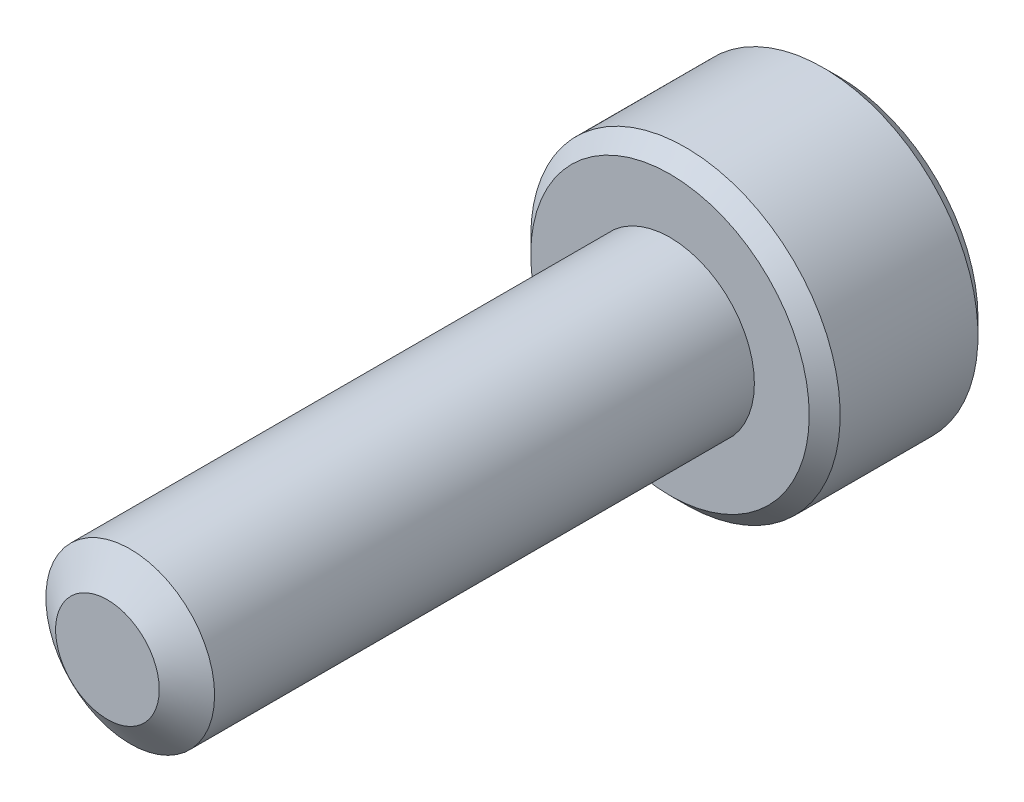
ISO-10303-21;
HEADER;
FILE_DESCRIPTION(('STEP AP214'),'2;1');
FILE_NAME('part.step','',(''),(''),'','','');
FILE_SCHEMA(('AUTOMOTIVE_DESIGN { 1 0 10303 214 1 1 1 1 }'));
ENDSEC;
DATA;
#1=APPLICATION_CONTEXT('core data for automotive mechanical design processes');
#2=APPLICATION_PROTOCOL_DEFINITION('international standard','automotive_design',2000,#1);
#3=PRODUCT_CONTEXT('',#1,'mechanical');
#4=PRODUCT('Part','Part','',(#3));
#5=PRODUCT_RELATED_PRODUCT_CATEGORY('part','',(#4));
#6=PRODUCT_DEFINITION_FORMATION('','',#4);
#7=PRODUCT_DEFINITION_CONTEXT('part definition',#1,'design');
#8=PRODUCT_DEFINITION('design','',#6,#7);
#9=PRODUCT_DEFINITION_SHAPE('','',#8);
#10=(LENGTH_UNIT() NAMED_UNIT(*) SI_UNIT(.MILLI.,.METRE.));
#11=(NAMED_UNIT(*) PLANE_ANGLE_UNIT() SI_UNIT($,.RADIAN.));
#12=(NAMED_UNIT(*) SI_UNIT($,.STERADIAN.) SOLID_ANGLE_UNIT());
#13=UNCERTAINTY_MEASURE_WITH_UNIT(LENGTH_MEASURE(1.E-05),#10,'distance_accuracy_value','');
#14=(GEOMETRIC_REPRESENTATION_CONTEXT(3) GLOBAL_UNCERTAINTY_ASSIGNED_CONTEXT((#13)) GLOBAL_UNIT_ASSIGNED_CONTEXT((#10,
#11,#12)) REPRESENTATION_CONTEXT('',''));
#15=CARTESIAN_POINT('',(0.,0.,0.));
#16=DIRECTION('',(0.,0.,1.));
#17=DIRECTION('',(1.,0.,0.));
#18=AXIS2_PLACEMENT_3D('',#15,#16,#17);
#19=CARTESIAN_POINT('',(0.,0.,-10.));
#20=DIRECTION('',(0.,0.,1.));
#21=DIRECTION('',(1.,0.,0.));
#22=AXIS2_PLACEMENT_3D('',#19,#20,#21);
#23=CYLINDRICAL_SURFACE('',#22,1.5);
#24=CARTESIAN_POINT('',(0.,0.,-10.));
#25=DIRECTION('',(0.,0.,-1.));
#26=DIRECTION('',(-1.,0.,0.));
#27=AXIS2_PLACEMENT_3D('',#24,#25,#26);
#28=CIRCLE('',#27,1.5);
#29=CARTESIAN_POINT('',(-1.5,0.,-10.));
#30=VERTEX_POINT('',#29);
#31=EDGE_CURVE('E209',#30,#30,#28,.F.);
#32=ORIENTED_EDGE('',*,*,#31,.T.);
#33=EDGE_LOOP('',(#32));
#34=FACE_BOUND('',#33,.T.);
#35=CARTESIAN_POINT('',(0.,0.,-0.40525178320938));
#36=DIRECTION('',(0.,0.,1.));
#37=DIRECTION('',(1.,0.,0.));
#38=AXIS2_PLACEMENT_3D('',#35,#36,#37);
#39=CIRCLE('',#38,1.5);
#40=CARTESIAN_POINT('',(1.5,0.,-0.40525178320938));
#41=VERTEX_POINT('',#40);
#42=EDGE_CURVE('E106',#41,#41,#39,.T.);
#43=ORIENTED_EDGE('',*,*,#42,.F.);
#44=EDGE_LOOP('',(#43));
#45=FACE_BOUND('',#44,.T.);
#46=ADVANCED_FACE('F32',(#34,#45),#23,.T.);
#47=CARTESIAN_POINT('',(0.,0.,0.));
#48=DIRECTION('',(0.,0.,-1.));
#49=DIRECTION('',(-1.,0.,0.));
#50=AXIS2_PLACEMENT_3D('',#47,#48,#49);
#51=CONICAL_SURFACE('',#50,0.921240473580834,0.959931088596884);
#52=ORIENTED_EDGE('',*,*,#42,.T.);
#53=EDGE_LOOP('',(#52));
#54=FACE_BOUND('',#53,.T.);
#55=CARTESIAN_POINT('',(0.,0.,0.));
#56=DIRECTION('',(0.,0.,1.));
#57=DIRECTION('',(1.,0.,0.));
#58=AXIS2_PLACEMENT_3D('',#55,#56,#57);
#59=CIRCLE('',#58,0.921240473580834);
#60=CARTESIAN_POINT('',(0.921240473580834,0.,0.));
#61=VERTEX_POINT('',#60);
#62=EDGE_CURVE('E207',#61,#61,#59,.T.);
#63=ORIENTED_EDGE('',*,*,#62,.F.);
#64=EDGE_LOOP('',(#63));
#65=FACE_BOUND('',#64,.T.);
#66=ADVANCED_FACE('F190',(#54,#65),#51,.T.);
#67=CARTESIAN_POINT('',(0.,0.,0.));
#68=DIRECTION('',(0.,0.,1.));
#69=DIRECTION('',(1.,0.,0.));
#70=AXIS2_PLACEMENT_3D('',#67,#68,#69);
#71=PLANE('',#70);
#72=ORIENTED_EDGE('',*,*,#62,.T.);
#73=EDGE_LOOP('',(#72));
#74=FACE_BOUND('',#73,.T.);
#75=ADVANCED_FACE('F187',(#74),#71,.T.);
#76=CARTESIAN_POINT('',(0.,0.,-13.));
#77=DIRECTION('',(0.,0.,1.));
#78=DIRECTION('',(1.,0.,0.));
#79=AXIS2_PLACEMENT_3D('',#76,#77,#78);
#80=CYLINDRICAL_SURFACE('',#79,2.75);
#81=CARTESIAN_POINT('',(0.,0.,-12.725));
#82=DIRECTION('',(0.,0.,-1.));
#83=DIRECTION('',(-1.,0.,0.));
#84=AXIS2_PLACEMENT_3D('',#81,#82,#83);
#85=CIRCLE('',#84,2.75);
#86=CARTESIAN_POINT('',(-2.75,0.,-12.725));
#87=VERTEX_POINT('',#86);
#88=EDGE_CURVE('E40',#87,#87,#85,.F.);
#89=ORIENTED_EDGE('',*,*,#88,.T.);
#90=EDGE_LOOP('',(#89));
#91=FACE_BOUND('',#90,.T.);
#92=CARTESIAN_POINT('',(0.,0.,-10.275));
#93=DIRECTION('',(0.,0.,-1.));
#94=DIRECTION('',(-1.,0.,0.));
#95=AXIS2_PLACEMENT_3D('',#92,#93,#94);
#96=CIRCLE('',#95,2.75);
#97=CARTESIAN_POINT('',(-2.75,0.,-10.275));
#98=VERTEX_POINT('',#97);
#99=EDGE_CURVE('E166',#98,#98,#96,.T.);
#100=ORIENTED_EDGE('',*,*,#99,.T.);
#101=EDGE_LOOP('',(#100));
#102=FACE_BOUND('',#101,.T.);
#103=ADVANCED_FACE('F171',(#91,#102),#80,.T.);
#104=CARTESIAN_POINT('',(0.,0.,-13.));
#105=DIRECTION('',(0.,0.,-1.));
#106=DIRECTION('',(-1.,0.,0.));
#107=AXIS2_PLACEMENT_3D('',#104,#105,#106);
#108=PLANE('',#107);
#109=CARTESIAN_POINT('',(0.,0.,-13.));
#110=DIRECTION('',(0.,0.,-1.));
#111=DIRECTION('',(-1.,0.,0.));
#112=AXIS2_PLACEMENT_3D('',#109,#110,#111);
#113=CIRCLE('',#112,2.475);
#114=CARTESIAN_POINT('',(-2.475,0.,-13.));
#115=VERTEX_POINT('',#114);
#116=EDGE_CURVE('E105',#115,#115,#113,.T.);
#117=ORIENTED_EDGE('',*,*,#116,.T.);
#118=EDGE_LOOP('',(#117));
#119=FACE_BOUND('',#118,.T.);
#120=CARTESIAN_POINT('',(0.,0.,-13.));
#121=DIRECTION('',(0.,0.,-1.));
#122=DIRECTION('',(-1.,0.,0.));
#123=AXIS2_PLACEMENT_3D('',#120,#121,#122);
#124=CIRCLE('',#123,1.44337567297406);
#125=CARTESIAN_POINT('',(-1.25,0.721687836487031,-13.));
#126=VERTEX_POINT('',#125);
#127=CARTESIAN_POINT('',(0.,1.44337567297406,-13.));
#128=VERTEX_POINT('',#127);
#129=EDGE_CURVE('E86',#126,#128,#124,.T.);
#130=ORIENTED_EDGE('',*,*,#129,.F.);
#131=CARTESIAN_POINT('',(-1.25,-0.721687836487032,-13.));
#132=VERTEX_POINT('',#131);
#133=EDGE_CURVE('E46',#132,#126,#124,.T.);
#134=ORIENTED_EDGE('',*,*,#133,.F.);
#135=CARTESIAN_POINT('',(0.,-1.44337567297406,-13.));
#136=VERTEX_POINT('',#135);
#137=EDGE_CURVE('E265',#136,#132,#124,.T.);
#138=ORIENTED_EDGE('',*,*,#137,.F.);
#139=CARTESIAN_POINT('',(1.25,-0.721687836487032,-13.));
#140=VERTEX_POINT('',#139);
#141=EDGE_CURVE('E53',#140,#136,#124,.T.);
#142=ORIENTED_EDGE('',*,*,#141,.F.);
#143=CARTESIAN_POINT('',(1.25,0.721687836487033,-13.));
#144=VERTEX_POINT('',#143);
#145=EDGE_CURVE('E127',#144,#140,#124,.T.);
#146=ORIENTED_EDGE('',*,*,#145,.F.);
#147=EDGE_CURVE('E95',#128,#144,#124,.T.);
#148=ORIENTED_EDGE('',*,*,#147,.F.);
#149=EDGE_LOOP('',(#130,#134,#138,#142,#146,#148));
#150=FACE_BOUND('',#149,.T.);
#151=ADVANCED_FACE('F126',(#119,#150),#108,.T.);
#152=CARTESIAN_POINT('',(0.,0.,-10.));
#153=DIRECTION('',(0.,0.,-1.));
#154=DIRECTION('',(-1.,0.,0.));
#155=AXIS2_PLACEMENT_3D('',#152,#153,#154);
#156=PLANE('',#155);
#157=CARTESIAN_POINT('',(0.,0.,-10.));
#158=DIRECTION('',(0.,0.,-1.));
#159=DIRECTION('',(-1.,0.,0.));
#160=AXIS2_PLACEMENT_3D('',#157,#158,#159);
#161=CIRCLE('',#160,2.475);
#162=CARTESIAN_POINT('',(-2.475,0.,-10.));
#163=VERTEX_POINT('',#162);
#164=EDGE_CURVE('E11',#163,#163,#161,.F.);
#165=ORIENTED_EDGE('',*,*,#164,.T.);
#166=EDGE_LOOP('',(#165));
#167=FACE_BOUND('',#166,.T.);
#168=ORIENTED_EDGE('',*,*,#31,.F.);
#169=EDGE_LOOP('',(#168));
#170=FACE_BOUND('',#169,.T.);
#171=ADVANCED_FACE('F180',(#167,#170),#156,.F.);
#172=CARTESIAN_POINT('',(0.,0.,-13.));
#173=DIRECTION('',(0.,0.,-1.));
#174=DIRECTION('',(-1.,0.,0.));
#175=AXIS2_PLACEMENT_3D('',#172,#173,#174);
#176=CONICAL_SURFACE('',#175,1.44337567297406,0.78539816339745);
#177=ORIENTED_EDGE('',*,*,#147,.T.);
#178=CARTESIAN_POINT('',(-0.000199999999999518,1.4434911430279,-13.0001154839091));
#179=CARTESIAN_POINT('',(0.0427751670715875,1.41867941875065,-12.9753216680551));
#180=CARTESIAN_POINT('',(0.0864690047459492,1.39345276980743,-12.9519837344187));
#181=CARTESIAN_POINT('',(0.175565930841943,1.34201263554194,-12.9092520040845));
#182=CARTESIAN_POINT('',(0.220977498357065,1.31579425481276,-12.8898819923604));
#183=CARTESIAN_POINT('',(0.312547820935261,1.26292610442246,-12.8567004834135));
#184=CARTESIAN_POINT('',(0.358683240175887,1.23628980770471,-12.8428055590527));
#185=CARTESIAN_POINT('',(0.451970080407593,1.18243062538508,-12.8213972821606));
#186=CARTESIAN_POINT('',(0.499118649136381,1.15520938653761,-12.8138679415668));
#187=CARTESIAN_POINT('',(0.580373556887253,1.10829684367467,-12.8070744980507));
#188=CARTESIAN_POINT('',(0.614374876627942,1.08866617256958,-12.8060685591044));
#189=CARTESIAN_POINT('',(0.682317764432479,1.04943932800611,-12.8077614149113));
#190=CARTESIAN_POINT('',(0.716259317655658,1.02984316311599,-12.8104610272155));
#191=CARTESIAN_POINT('',(0.7838148564575,0.990839954603498,-12.8194089303164));
#192=CARTESIAN_POINT('',(0.817428507286776,0.97143310424877,-12.8256605258997));
#193=CARTESIAN_POINT('',(0.884094638217814,0.932943395609905,-12.8413756814139));
#194=CARTESIAN_POINT('',(0.917146871030297,0.9138606800983,-12.8508406200875));
#195=CARTESIAN_POINT('',(1.00179969160026,0.864986351354567,-12.8789313906876));
#196=CARTESIAN_POINT('',(1.05286649242964,0.835502920149076,-12.8996701574522));
#197=CARTESIAN_POINT('',(1.15300085411325,0.777690319475909,-12.9463871346715));
#198=CARTESIAN_POINT('',(1.20207431157827,0.749357745598417,-12.9723482959468));
#199=CARTESIAN_POINT('',(1.2502,0.721572366433194,-13.0001154839091));
#200=B_SPLINE_CURVE_WITH_KNOTS('',3,(#178,#179,#180,#181,#182,#183,#184,#185,#186,#187,#188,
#189,#190,#191,#192,#193,#194,#195,#196,#197,#198,#199),.UNSPECIFIED.,.F.,.F.,(4,2,2,2,2,2,2,2,
2,2,4),(0.,0.166533409618305,0.334037607289762,0.498880396489699,0.663307919240275,
0.780963963458827,0.898645970148453,1.01643764860773,1.1342799317155,1.32148652032141,
1.50809158792573),.UNSPECIFIED.);
#201=EDGE_CURVE('E100',#128,#144,#200,.T.);
#202=ORIENTED_EDGE('',*,*,#201,.F.);
#203=EDGE_LOOP('',(#177,#202));
#204=FACE_BOUND('',#203,.T.);
#205=ADVANCED_FACE('F101',(#204),#176,.F.);
#206=ORIENTED_EDGE('',*,*,#145,.T.);
#207=CARTESIAN_POINT('',(1.25,-1.43934010808077,-13.4629820968923));
#208=CARTESIAN_POINT('',(1.25,-1.40429313005659,-13.4365249226329));
#209=CARTESIAN_POINT('',(1.25,-1.36905087135599,-13.4103271603543));
#210=CARTESIAN_POINT('',(1.25,-1.29809650706311,-13.3585575718396));
#211=CARTESIAN_POINT('',(1.25,-1.26238428576495,-13.3329859043563));
#212=CARTESIAN_POINT('',(1.25,-1.15390111792708,-13.2570059936895));
#213=CARTESIAN_POINT('',(1.25,-1.08031646726264,-13.2077402861896));
#214=CARTESIAN_POINT('',(1.25,-0.926012322755096,-13.1110258302631));
#215=CARTESIAN_POINT('',(1.25,-0.845125318656147,-13.0638412989418));
#216=CARTESIAN_POINT('',(1.25,-0.679311174076603,-12.9775307343904));
#217=CARTESIAN_POINT('',(1.25,-0.594398891026688,-12.9383775346269));
#218=CARTESIAN_POINT('',(1.25,-0.46694481246074,-12.8904772236883));
#219=CARTESIAN_POINT('',(1.25,-0.426289985812821,-12.8767294897863));
#220=CARTESIAN_POINT('',(1.25,-0.343998850091267,-12.8524979274505));
#221=CARTESIAN_POINT('',(1.25,-0.302362473614962,-12.8420143238698));
#222=CARTESIAN_POINT('',(1.25,-0.219052696285665,-12.8250301617483));
#223=CARTESIAN_POINT('',(1.25,-0.1773934284745,-12.8184613604714));
#224=CARTESIAN_POINT('',(1.25,-0.093629369340192,-12.8094350534578));
#225=CARTESIAN_POINT('',(1.25,-0.051524655854396,-12.8069768409973));
#226=CARTESIAN_POINT('',(1.25,0.0311890576306316,-12.8063540620133));
#227=CARTESIAN_POINT('',(1.25,0.0717969625499305,-12.8080371168462));
#228=CARTESIAN_POINT('',(1.25,0.152668636885197,-12.8152682705979));
#229=CARTESIAN_POINT('',(1.25,0.192932338835358,-12.8208171104131));
#230=CARTESIAN_POINT('',(1.25,0.273499879165296,-12.835571036465));
#231=CARTESIAN_POINT('',(1.25,0.313792180618512,-12.8448381759641));
#232=CARTESIAN_POINT('',(1.25,0.393496413911458,-12.8665361784573));
#233=CARTESIAN_POINT('',(1.25,0.43290841911506,-12.8789667767306));
#234=CARTESIAN_POINT('',(1.25,0.556992735862298,-12.9227793529314));
#235=CARTESIAN_POINT('',(1.25,0.639898924666086,-12.959151072876));
#236=CARTESIAN_POINT('',(1.25,0.801816555499702,-13.0400191621783));
#237=CARTESIAN_POINT('',(1.25,0.880812666325045,-13.084544720912));
#238=CARTESIAN_POINT('',(1.25,1.0317856127975,-13.1764048766666));
#239=CARTESIAN_POINT('',(1.25,1.10391618485086,-13.2234899339163));
#240=CARTESIAN_POINT('',(1.25,1.21018606043311,-13.2962785615985));
#241=CARTESIAN_POINT('',(1.25,1.2451506996938,-13.3207980853934));
#242=CARTESIAN_POINT('',(1.25,1.31460220852737,-13.3704856367657));
#243=CARTESIAN_POINT('',(1.25,1.34908920596618,-13.3956534854155));
#244=CARTESIAN_POINT('',(1.25,1.38337731682912,-13.4210901488412));
#245=B_SPLINE_CURVE_WITH_KNOTS('',3,(#207,#208,#209,#210,#211,#212,#213,#214,#215,#216,#217,
#218,#219,#220,#221,#222,#223,#224,#225,#226,#227,#228,#229,#230,#231,#232,#233,#234,#235,#236,
#237,#238,#239,#240,#241,#242,#243,#244),.UNSPECIFIED.,.F.,.F.,(4,2,2,2,2,2,2,2,2,2,2,2,2,2,2,2,
2,2,4),(0.,0.131732960381448,0.263498984161645,0.529042014455825,0.809741926134617,
1.08947609717225,1.21811634272576,1.346765447839,1.47310084517844,1.59941451973784,
1.72115042167849,1.84290966131735,1.96679153905342,2.09066305366039,2.36146692896009,
2.63325989198491,2.89154668212279,3.01965734507713,3.14773302245628),.UNSPECIFIED.);
#246=EDGE_CURVE('E94',#144,#140,#245,.F.);
#247=ORIENTED_EDGE('',*,*,#246,.F.);
#248=EDGE_LOOP('',(#206,#247));
#249=FACE_BOUND('',#248,.T.);
#250=ADVANCED_FACE('F271',(#249),#176,.F.);
#251=ORIENTED_EDGE('',*,*,#141,.T.);
#252=CARTESIAN_POINT('',(1.2502,-0.721572366433195,-13.0001154839091));
#253=CARTESIAN_POINT('',(1.20722483292841,-0.746384090710445,-12.9753216680551));
#254=CARTESIAN_POINT('',(1.16353099525405,-0.771610739653665,-12.9519837344187));
#255=CARTESIAN_POINT('',(1.07443406915806,-0.823050873919155,-12.9092520040845));
#256=CARTESIAN_POINT('',(1.02902250164294,-0.849269254648334,-12.8898819923604));
#257=CARTESIAN_POINT('',(0.93745217906474,-0.902137405038636,-12.8567004834135));
#258=CARTESIAN_POINT('',(0.891316759824114,-0.928773701756388,-12.8428055590527));
#259=CARTESIAN_POINT('',(0.798029919592408,-0.982632884076013,-12.8213972821606));
#260=CARTESIAN_POINT('',(0.75088135086362,-1.00985412292348,-12.8138679415668));
#261=CARTESIAN_POINT('',(0.669626443112748,-1.05676666578643,-12.8070744980507));
#262=CARTESIAN_POINT('',(0.635625123372059,-1.07639733689152,-12.8060685591044));
#263=CARTESIAN_POINT('',(0.567682235567523,-1.11562418145499,-12.8077614149113));
#264=CARTESIAN_POINT('',(0.533740682344343,-1.1352203463451,-12.8104610272155));
#265=CARTESIAN_POINT('',(0.466185143542501,-1.1742235548576,-12.8194089303164));
#266=CARTESIAN_POINT('',(0.432571492713226,-1.19363040521233,-12.8256605258997));
#267=CARTESIAN_POINT('',(0.365905361782187,-1.23212011385119,-12.8413756814139));
#268=CARTESIAN_POINT('',(0.332853128969705,-1.2512028293628,-12.8508406200875));
#269=CARTESIAN_POINT('',(0.248200308399736,-1.30007715810653,-12.8789313906876));
#270=CARTESIAN_POINT('',(0.197133507570362,-1.32956058931202,-12.8996701574522));
#271=CARTESIAN_POINT('',(0.0969991458867458,-1.38737318998519,-12.9463871346715));
#272=CARTESIAN_POINT('',(0.0479256884217313,-1.41570576386268,-12.9723482959468));
#273=CARTESIAN_POINT('',(-0.000199999999999432,-1.4434911430279,-13.0001154839091));
#274=B_SPLINE_CURVE_WITH_KNOTS('',3,(#252,#253,#254,#255,#256,#257,#258,#259,#260,#261,#262,
#263,#264,#265,#266,#267,#268,#269,#270,#271,#272,#273),.UNSPECIFIED.,.F.,.F.,(4,2,2,2,2,2,2,2,
2,2,4),(0.,0.166533409618304,0.334037607289761,0.498880396489698,0.663307919240274,
0.780963963458826,0.898645970148452,1.01643764860773,1.13427993171549,1.32148652032141,
1.50809158792573),.UNSPECIFIED.);
#275=EDGE_CURVE('E136',#140,#136,#274,.T.);
#276=ORIENTED_EDGE('',*,*,#275,.F.);
#277=EDGE_LOOP('',(#251,#276));
#278=FACE_BOUND('',#277,.T.);
#279=ADVANCED_FACE('F268',(#278),#176,.F.);
#280=ORIENTED_EDGE('',*,*,#137,.T.);
#281=CARTESIAN_POINT('',(0.000200000000000315,-1.4434911430279,-13.0001154839091));
#282=CARTESIAN_POINT('',(-0.0427751670715862,-1.41867941875065,-12.9753216680551));
#283=CARTESIAN_POINT('',(-0.0864690047459475,-1.39345276980743,-12.9519837344187));
#284=CARTESIAN_POINT('',(-0.175565930841941,-1.34201263554194,-12.9092520040845));
#285=CARTESIAN_POINT('',(-0.220977498357063,-1.31579425481276,-12.8898819923604));
#286=CARTESIAN_POINT('',(-0.312547820935259,-1.26292610442246,-12.8567004834135));
#287=CARTESIAN_POINT('',(-0.358683240175885,-1.23628980770471,-12.8428055590527));
#288=CARTESIAN_POINT('',(-0.451970080407592,-1.18243062538508,-12.8213972821606));
#289=CARTESIAN_POINT('',(-0.499118649136379,-1.15520938653761,-12.8138679415668));
#290=CARTESIAN_POINT('',(-0.580373556887252,-1.10829684367467,-12.8070744980507));
#291=CARTESIAN_POINT('',(-0.61437487662794,-1.08866617256958,-12.8060685591044));
#292=CARTESIAN_POINT('',(-0.682317764432477,-1.04943932800611,-12.8077614149113));
#293=CARTESIAN_POINT('',(-0.716259317655657,-1.02984316311599,-12.8104610272155));
#294=CARTESIAN_POINT('',(-0.783814856457499,-0.9908399546035,-12.8194089303164));
#295=CARTESIAN_POINT('',(-0.817428507286774,-0.971433104248772,-12.8256605258997));
#296=CARTESIAN_POINT('',(-0.884094638217813,-0.932943395609906,-12.8413756814139));
#297=CARTESIAN_POINT('',(-0.917146871030295,-0.913860680098301,-12.8508406200875));
#298=CARTESIAN_POINT('',(-1.00179969160026,-0.864986351354568,-12.8789313906876));
#299=CARTESIAN_POINT('',(-1.05286649242964,-0.835502920149076,-12.8996701574522));
#300=CARTESIAN_POINT('',(-1.15300085411326,-0.777690319475909,-12.9463871346715));
#301=CARTESIAN_POINT('',(-1.20207431157827,-0.749357745598417,-12.9723482959468));
#302=CARTESIAN_POINT('',(-1.2502,-0.721572366433195,-13.0001154839091));
#303=B_SPLINE_CURVE_WITH_KNOTS('',3,(#281,#282,#283,#284,#285,#286,#287,#288,#289,#290,#291,
#292,#293,#294,#295,#296,#297,#298,#299,#300,#301,#302),.UNSPECIFIED.,.F.,.F.,(4,2,2,2,2,2,2,2,
2,2,4),(0.,0.166533409618303,0.334037607289761,0.498880396489698,0.663307919240274,
0.780963963458826,0.898645970148453,1.01643764860773,1.13427993171549,1.32148652032141,
1.50809158792574),.UNSPECIFIED.);
#304=EDGE_CURVE('E243',#136,#132,#303,.T.);
#305=ORIENTED_EDGE('',*,*,#304,.F.);
#306=EDGE_LOOP('',(#280,#305));
#307=FACE_BOUND('',#306,.T.);
#308=ADVANCED_FACE('F267',(#307),#176,.F.);
#309=ORIENTED_EDGE('',*,*,#133,.T.);
#310=CARTESIAN_POINT('',(-1.25,-1.43934010829019,-13.4629820970504));
#311=CARTESIAN_POINT('',(-1.25,-1.40429313026013,-13.4365249227849));
#312=CARTESIAN_POINT('',(-1.25,-1.36905087155364,-13.4103271605002));
#313=CARTESIAN_POINT('',(-1.25,-1.29809650724891,-13.3585575719734));
#314=CARTESIAN_POINT('',(-1.25,-1.2623842859448,-13.3329859044841));
#315=CARTESIAN_POINT('',(-1.25,-1.1539011180887,-13.257005993799));
#316=CARTESIAN_POINT('',(-1.25,-1.08031646741187,-13.207740286287));
#317=CARTESIAN_POINT('',(-1.25,-0.926012322877301,-13.1110258303356));
#318=CARTESIAN_POINT('',(-1.25,-0.845125318763648,-13.0638412990016));
#319=CARTESIAN_POINT('',(-1.25,-0.679311174153443,-12.9775307344266));
#320=CARTESIAN_POINT('',(-1.25,-0.594398891087584,-12.9383775346522));
#321=CARTESIAN_POINT('',(-1.25,-0.466944812509639,-12.8904772237056));
#322=CARTESIAN_POINT('',(-1.25,-0.426289985866744,-12.8767294898039));
#323=CARTESIAN_POINT('',(-1.25,-0.343998850155402,-12.8524979274677));
#324=CARTESIAN_POINT('',(-1.25,-0.302362473684285,-12.8420143238863));
#325=CARTESIAN_POINT('',(-1.25,-0.219052696365195,-12.8250301617622));
#326=CARTESIAN_POINT('',(-1.25,-0.177393428559044,-12.8184613604834));
#327=CARTESIAN_POINT('',(-1.25,-0.0936293694345978,-12.809435053465));
#328=CARTESIAN_POINT('',(-1.25,-0.0515246559536487,-12.8069768410015));
#329=CARTESIAN_POINT('',(-1.25,0.0311890575224387,-12.8063540620107));
#330=CARTESIAN_POINT('',(-1.25,0.0717969624376319,-12.8080371168399));
#331=CARTESIAN_POINT('',(-1.25,0.152668636765093,-12.8152682705835));
#332=CARTESIAN_POINT('',(-1.25,0.192932338711554,-12.8208171103943));
#333=CARTESIAN_POINT('',(-1.25,0.273499879034189,-12.835571036437));
#334=CARTESIAN_POINT('',(-1.25,0.313792180483814,-12.8448381759314));
#335=CARTESIAN_POINT('',(-1.25,0.393496413769925,-12.8665361784149));
#336=CARTESIAN_POINT('',(-1.25,0.432908418970283,-12.8789667766833));
#337=CARTESIAN_POINT('',(-1.25,0.556992735685997,-12.9227793528609));
#338=CARTESIAN_POINT('',(-1.25,0.639898924463083,-12.9591510727842));
#339=CARTESIAN_POINT('',(-1.25,0.801816555245347,-13.0400191620416));
#340=CARTESIAN_POINT('',(-1.25,0.880812666046053,-13.0845447207516));
#341=CARTESIAN_POINT('',(-1.25,1.03178561247421,-13.176404876461));
#342=CARTESIAN_POINT('',(-1.25,1.10391618450775,-13.2234899336892));
#343=CARTESIAN_POINT('',(-1.25,1.2101860600607,-13.2962785613395));
#344=CARTESIAN_POINT('',(-1.25,1.24515069931176,-13.3207980851238));
#345=CARTESIAN_POINT('',(-1.25,1.31460220812614,-13.3704856364749));
#346=CARTESIAN_POINT('',(-1.25,1.3490892055554,-13.3956534851142));
#347=CARTESIAN_POINT('',(-1.25,1.38337731640879,-13.4210901485293));
#348=B_SPLINE_CURVE_WITH_KNOTS('',3,(#310,#311,#312,#313,#314,#315,#316,#317,#318,#319,#320,
#321,#322,#323,#324,#325,#326,#327,#328,#329,#330,#331,#332,#333,#334,#335,#336,#337,#338,#339,
#340,#341,#342,#343,#344,#345,#346,#347),.UNSPECIFIED.,.F.,.F.,(4,2,2,2,2,2,2,2,2,2,2,2,2,2,2,2,
2,2,4),(0.,0.131732960406521,0.263498984211801,0.529042014557081,0.809741926293178,
1.08947609738757,1.21811634292656,1.34676544802529,1.47310084535082,1.59941451989631,
1.72115042182424,1.84290966145034,1.96679153917269,2.09066305376595,2.36146692896707,
2.63325989189267,2.89154668194565,3.01965734485811,3.1477330221954),.UNSPECIFIED.);
#349=EDGE_CURVE('E116',#132,#126,#348,.T.);
#350=ORIENTED_EDGE('',*,*,#349,.F.);
#351=EDGE_LOOP('',(#309,#350));
#352=FACE_BOUND('',#351,.T.);
#353=ADVANCED_FACE('F280',(#352),#176,.F.);
#354=ORIENTED_EDGE('',*,*,#129,.T.);
#355=CARTESIAN_POINT('',(-1.2502,0.721572366433194,-13.0001154839091));
#356=CARTESIAN_POINT('',(-1.20722483292841,0.746384090710444,-12.9753216680551));
#357=CARTESIAN_POINT('',(-1.16353099525405,0.771610739653664,-12.9519837344187));
#358=CARTESIAN_POINT('',(-1.07443406915806,0.823050873919154,-12.9092520040845));
#359=CARTESIAN_POINT('',(-1.02902250164294,0.849269254648333,-12.8898819923604));
#360=CARTESIAN_POINT('',(-0.937452179064741,0.902137405038635,-12.8567004834135));
#361=CARTESIAN_POINT('',(-0.891316759824115,0.928773701756387,-12.8428055590527));
#362=CARTESIAN_POINT('',(-0.798029919592407,0.982632884076013,-12.8213972821606));
#363=CARTESIAN_POINT('',(-0.75088135086362,1.00985412292348,-12.8138679415668));
#364=CARTESIAN_POINT('',(-0.669626443112747,1.05676666578643,-12.8070744980507));
#365=CARTESIAN_POINT('',(-0.635625123372059,1.07639733689152,-12.8060685591044));
#366=CARTESIAN_POINT('',(-0.567682235567522,1.11562418145499,-12.8077614149113));
#367=CARTESIAN_POINT('',(-0.533740682344342,1.1352203463451,-12.8104610272155));
#368=CARTESIAN_POINT('',(-0.4661851435425,1.1742235548576,-12.8194089303164));
#369=CARTESIAN_POINT('',(-0.432571492713225,1.19363040521233,-12.8256605258997));
#370=CARTESIAN_POINT('',(-0.365905361782186,1.23212011385119,-12.8413756814139));
#371=CARTESIAN_POINT('',(-0.332853128969704,1.2512028293628,-12.8508406200875));
#372=CARTESIAN_POINT('',(-0.248200308399735,1.30007715810653,-12.8789313906876));
#373=CARTESIAN_POINT('',(-0.197133507570361,1.32956058931202,-12.8996701574522));
#374=CARTESIAN_POINT('',(-0.096999145886745,1.38737318998519,-12.9463871346715));
#375=CARTESIAN_POINT('',(-0.0479256884217305,1.41570576386268,-12.9723482959468));
#376=CARTESIAN_POINT('',(0.000200000000000219,1.4434911430279,-13.0001154839091));
#377=B_SPLINE_CURVE_WITH_KNOTS('',3,(#355,#356,#357,#358,#359,#360,#361,#362,#363,#364,#365,
#366,#367,#368,#369,#370,#371,#372,#373,#374,#375,#376),.UNSPECIFIED.,.F.,.F.,(4,2,2,2,2,2,2,2,
2,2,4),(0.,0.166533409618305,0.334037607289762,0.498880396489699,0.663307919240276,
0.780963963458828,0.898645970148454,1.01643764860773,1.1342799317155,1.32148652032141,
1.50809158792574),.UNSPECIFIED.);
#378=EDGE_CURVE('E90',#126,#128,#377,.T.);
#379=ORIENTED_EDGE('',*,*,#378,.F.);
#380=EDGE_LOOP('',(#354,#379));
#381=FACE_BOUND('',#380,.T.);
#382=ADVANCED_FACE('F88',(#381),#176,.F.);
#383=CARTESIAN_POINT('',(1.25,2.1650635094611,-11.125));
#384=DIRECTION('',(0.,0.,-1.));
#385=DIRECTION('',(-1.,0.,0.));
#386=AXIS2_PLACEMENT_3D('',#383,#384,#385);
#387=PLANE('',#386);
#388=DIRECTION('',(0.866025403784439,0.5,0.));
#389=VECTOR('',#388,1.);
#390=CARTESIAN_POINT('',(-1.25,0.721687836487032,-11.125));
#391=LINE('',#390,#389);
#392=CARTESIAN_POINT('',(-1.25,0.721687836487032,-11.125));
#393=VERTEX_POINT('',#392);
#394=CARTESIAN_POINT('',(0.,1.44337567297406,-11.125));
#395=VERTEX_POINT('',#394);
#396=EDGE_CURVE('E115',#393,#395,#391,.T.);
#397=ORIENTED_EDGE('',*,*,#396,.T.);
#398=DIRECTION('',(0.866025403784439,-0.5,0.));
#399=VECTOR('',#398,1.);
#400=CARTESIAN_POINT('',(0.,1.44337567297406,-11.125));
#401=LINE('',#400,#399);
#402=CARTESIAN_POINT('',(1.25,0.721687836487032,-11.125));
#403=VERTEX_POINT('',#402);
#404=EDGE_CURVE('E120',#395,#403,#401,.T.);
#405=ORIENTED_EDGE('',*,*,#404,.T.);
#406=DIRECTION('',(0.,-1.,0.));
#407=VECTOR('',#406,1.);
#408=CARTESIAN_POINT('',(1.25,0.721687836487032,-11.125));
#409=LINE('',#408,#407);
#410=CARTESIAN_POINT('',(1.25,-0.721687836487033,-11.125));
#411=VERTEX_POINT('',#410);
#412=EDGE_CURVE('E231',#403,#411,#409,.T.);
#413=ORIENTED_EDGE('',*,*,#412,.T.);
#414=DIRECTION('',(-0.866025403784439,-0.5,0.));
#415=VECTOR('',#414,1.);
#416=CARTESIAN_POINT('',(1.25,-0.721687836487033,-11.125));
#417=LINE('',#416,#415);
#418=CARTESIAN_POINT('',(0.,-1.44337567297406,-11.125));
#419=VERTEX_POINT('',#418);
#420=EDGE_CURVE('E228',#411,#419,#417,.T.);
#421=ORIENTED_EDGE('',*,*,#420,.T.);
#422=DIRECTION('',(-0.866025403784439,0.5,0.));
#423=VECTOR('',#422,1.);
#424=CARTESIAN_POINT('',(0.,-1.44337567297406,-11.125));
#425=LINE('',#424,#423);
#426=CARTESIAN_POINT('',(-1.25,-0.721687836487032,-11.125));
#427=VERTEX_POINT('',#426);
#428=EDGE_CURVE('E225',#419,#427,#425,.T.);
#429=ORIENTED_EDGE('',*,*,#428,.T.);
#430=DIRECTION('',(0.,1.,0.));
#431=VECTOR('',#430,1.);
#432=CARTESIAN_POINT('',(-1.25,-0.721687836487032,-11.125));
#433=LINE('',#432,#431);
#434=EDGE_CURVE('E123',#427,#393,#433,.T.);
#435=ORIENTED_EDGE('',*,*,#434,.T.);
#436=EDGE_LOOP('',(#397,#405,#413,#421,#429,#435));
#437=FACE_BOUND('',#436,.T.);
#438=ADVANCED_FACE('F155',(#437),#387,.T.);
#439=CARTESIAN_POINT('',(0.,1.44337567297406,-11.125));
#440=DIRECTION('',(0.5,0.866025403784439,0.));
#441=DIRECTION('',(-0.866025403784439,0.5,0.));
#442=AXIS2_PLACEMENT_3D('',#439,#440,#441);
#443=PLANE('',#442);
#444=DIRECTION('',(0.,0.,-1.));
#445=VECTOR('',#444,1.);
#446=CARTESIAN_POINT('',(0.,1.44337567297406,-11.125));
#447=LINE('',#446,#445);
#448=EDGE_CURVE('E112',#395,#128,#447,.T.);
#449=ORIENTED_EDGE('',*,*,#448,.T.);
#450=ORIENTED_EDGE('',*,*,#201,.T.);
#451=DIRECTION('',(0.,0.,-1.));
#452=VECTOR('',#451,1.);
#453=CARTESIAN_POINT('',(1.25,0.721687836487032,-11.125));
#454=LINE('',#453,#452);
#455=EDGE_CURVE('E122',#403,#144,#454,.T.);
#456=ORIENTED_EDGE('',*,*,#455,.F.);
#457=ORIENTED_EDGE('',*,*,#404,.F.);
#458=EDGE_LOOP('',(#449,#450,#456,#457));
#459=FACE_BOUND('',#458,.T.);
#460=ADVANCED_FACE('F118',(#459),#443,.F.);
#461=CARTESIAN_POINT('',(1.25,0.721687836487032,-11.125));
#462=DIRECTION('',(1.,0.,0.));
#463=DIRECTION('',(0.,0.,-1.));
#464=AXIS2_PLACEMENT_3D('',#461,#462,#463);
#465=PLANE('',#464);
#466=ORIENTED_EDGE('',*,*,#455,.T.);
#467=ORIENTED_EDGE('',*,*,#246,.T.);
#468=DIRECTION('',(0.,0.,-1.));
#469=VECTOR('',#468,1.);
#470=CARTESIAN_POINT('',(1.25,-0.721687836487033,-11.125));
#471=LINE('',#470,#469);
#472=EDGE_CURVE('E214',#411,#140,#471,.T.);
#473=ORIENTED_EDGE('',*,*,#472,.F.);
#474=ORIENTED_EDGE('',*,*,#412,.F.);
#475=EDGE_LOOP('',(#466,#467,#473,#474));
#476=FACE_BOUND('',#475,.T.);
#477=ADVANCED_FACE('F144',(#476),#465,.F.);
#478=CARTESIAN_POINT('',(1.25,-0.721687836487033,-11.125));
#479=DIRECTION('',(0.5,-0.866025403784439,0.));
#480=DIRECTION('',(0.866025403784439,0.5,0.));
#481=AXIS2_PLACEMENT_3D('',#478,#479,#480);
#482=PLANE('',#481);
#483=ORIENTED_EDGE('',*,*,#472,.T.);
#484=ORIENTED_EDGE('',*,*,#275,.T.);
#485=DIRECTION('',(0.,0.,-1.));
#486=VECTOR('',#485,1.);
#487=CARTESIAN_POINT('',(0.,-1.44337567297406,-11.125));
#488=LINE('',#487,#486);
#489=EDGE_CURVE('E217',#419,#136,#488,.T.);
#490=ORIENTED_EDGE('',*,*,#489,.F.);
#491=ORIENTED_EDGE('',*,*,#420,.F.);
#492=EDGE_LOOP('',(#483,#484,#490,#491));
#493=FACE_BOUND('',#492,.T.);
#494=ADVANCED_FACE('F148',(#493),#482,.F.);
#495=CARTESIAN_POINT('',(0.,-1.44337567297406,-11.125));
#496=DIRECTION('',(-0.5,-0.866025403784439,0.));
#497=DIRECTION('',(0.866025403784439,-0.5,0.));
#498=AXIS2_PLACEMENT_3D('',#495,#496,#497);
#499=PLANE('',#498);
#500=ORIENTED_EDGE('',*,*,#489,.T.);
#501=ORIENTED_EDGE('',*,*,#304,.T.);
#502=DIRECTION('',(0.,0.,-1.));
#503=VECTOR('',#502,1.);
#504=CARTESIAN_POINT('',(-1.25,-0.721687836487032,-11.125));
#505=LINE('',#504,#503);
#506=EDGE_CURVE('E220',#427,#132,#505,.T.);
#507=ORIENTED_EDGE('',*,*,#506,.F.);
#508=ORIENTED_EDGE('',*,*,#428,.F.);
#509=EDGE_LOOP('',(#500,#501,#507,#508));
#510=FACE_BOUND('',#509,.T.);
#511=ADVANCED_FACE('F250',(#510),#499,.F.);
#512=CARTESIAN_POINT('',(-1.25,-0.721687836487032,-11.125));
#513=DIRECTION('',(-1.,0.,0.));
#514=DIRECTION('',(0.,-1.,0.));
#515=AXIS2_PLACEMENT_3D('',#512,#513,#514);
#516=PLANE('',#515);
#517=ORIENTED_EDGE('',*,*,#506,.T.);
#518=ORIENTED_EDGE('',*,*,#349,.T.);
#519=DIRECTION('',(0.,0.,-1.));
#520=VECTOR('',#519,1.);
#521=CARTESIAN_POINT('',(-1.25,0.721687836487032,-11.125));
#522=LINE('',#521,#520);
#523=EDGE_CURVE('E114',#393,#126,#522,.T.);
#524=ORIENTED_EDGE('',*,*,#523,.F.);
#525=ORIENTED_EDGE('',*,*,#434,.F.);
#526=EDGE_LOOP('',(#517,#518,#524,#525));
#527=FACE_BOUND('',#526,.T.);
#528=ADVANCED_FACE('F247',(#527),#516,.F.);
#529=CARTESIAN_POINT('',(-1.25,0.721687836487032,-11.125));
#530=DIRECTION('',(-0.5,0.866025403784439,0.));
#531=DIRECTION('',(-0.866025403784439,-0.5,0.));
#532=AXIS2_PLACEMENT_3D('',#529,#530,#531);
#533=PLANE('',#532);
#534=ORIENTED_EDGE('',*,*,#523,.T.);
#535=ORIENTED_EDGE('',*,*,#378,.T.);
#536=ORIENTED_EDGE('',*,*,#448,.F.);
#537=ORIENTED_EDGE('',*,*,#396,.F.);
#538=EDGE_LOOP('',(#534,#535,#536,#537));
#539=FACE_BOUND('',#538,.T.);
#540=ADVANCED_FACE('F110',(#539),#533,.F.);
#541=CARTESIAN_POINT('',(0.,0.,-13.));
#542=DIRECTION('',(0.,0.,1.));
#543=DIRECTION('',(1.,0.,0.));
#544=AXIS2_PLACEMENT_3D('',#541,#542,#543);
#545=CONICAL_SURFACE('',#544,2.475,0.785398163397447);
#546=ORIENTED_EDGE('',*,*,#88,.F.);
#547=EDGE_LOOP('',(#546));
#548=FACE_BOUND('',#547,.T.);
#549=ORIENTED_EDGE('',*,*,#116,.F.);
#550=EDGE_LOOP('',(#549));
#551=FACE_BOUND('',#550,.T.);
#552=ADVANCED_FACE('F174',(#548,#551),#545,.T.);
#553=CARTESIAN_POINT('',(0.,0.,-10.275));
#554=DIRECTION('',(0.,0.,-1.));
#555=DIRECTION('',(-1.,0.,0.));
#556=AXIS2_PLACEMENT_3D('',#553,#554,#555);
#557=CONICAL_SURFACE('',#556,2.75,0.785398163397456);
#558=ORIENTED_EDGE('',*,*,#164,.F.);
#559=EDGE_LOOP('',(#558));
#560=FACE_BOUND('',#559,.T.);
#561=ORIENTED_EDGE('',*,*,#99,.F.);
#562=EDGE_LOOP('',(#561));
#563=FACE_BOUND('',#562,.T.);
#564=ADVANCED_FACE('F34',(#560,#563),#557,.T.);
#565=CLOSED_SHELL('',(#46,#66,#75,#103,#151,#171,#205,#250,#279,#308,#353,#382,#438,#460,#477,
#494,#511,#528,#540,#552,#564));
#566=MANIFOLD_SOLID_BREP('B2',#565);
#567=ADVANCED_BREP_SHAPE_REPRESENTATION('',(#18,#566),#14);
#568=SHAPE_DEFINITION_REPRESENTATION(#9,#567);
ENDSEC;
END-ISO-10303-21;
